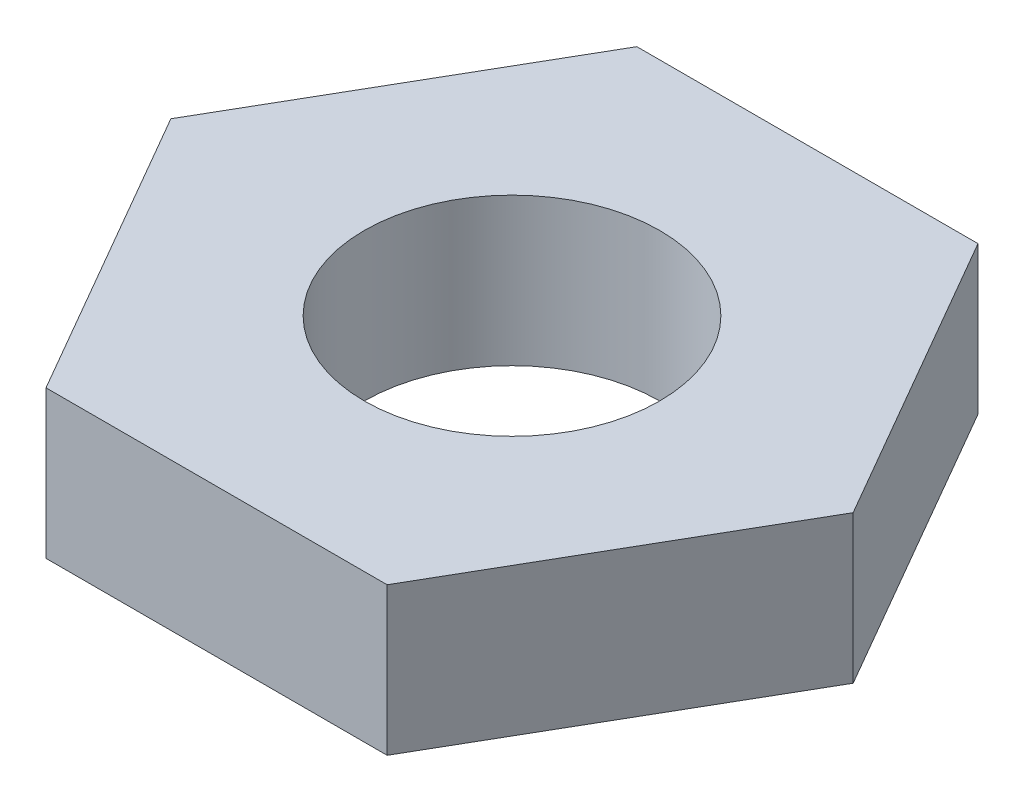
ISO-10303-21;
HEADER;
FILE_DESCRIPTION(('STEP AP214'),'2;1');
FILE_NAME('part.step','',(''),(''),'','','');
FILE_SCHEMA(('AUTOMOTIVE_DESIGN { 1 0 10303 214 1 1 1 1 }'));
ENDSEC;
DATA;
#1=APPLICATION_CONTEXT('core data for automotive mechanical design processes');
#2=APPLICATION_PROTOCOL_DEFINITION('international standard','automotive_design',2000,#1);
#3=PRODUCT_CONTEXT('',#1,'mechanical');
#4=PRODUCT('Part','Part','',(#3));
#5=PRODUCT_RELATED_PRODUCT_CATEGORY('part','',(#4));
#6=PRODUCT_DEFINITION_FORMATION('','',#4);
#7=PRODUCT_DEFINITION_CONTEXT('part definition',#1,'design');
#8=PRODUCT_DEFINITION('design','',#6,#7);
#9=PRODUCT_DEFINITION_SHAPE('','',#8);
#10=(LENGTH_UNIT() NAMED_UNIT(*) SI_UNIT(.MILLI.,.METRE.));
#11=(NAMED_UNIT(*) PLANE_ANGLE_UNIT() SI_UNIT($,.RADIAN.));
#12=(NAMED_UNIT(*) SI_UNIT($,.STERADIAN.) SOLID_ANGLE_UNIT());
#13=UNCERTAINTY_MEASURE_WITH_UNIT(LENGTH_MEASURE(1.E-05),#10,'distance_accuracy_value','');
#14=(GEOMETRIC_REPRESENTATION_CONTEXT(3) GLOBAL_UNCERTAINTY_ASSIGNED_CONTEXT((#13)) GLOBAL_UNIT_ASSIGNED_CONTEXT((#10,
#11,#12)) REPRESENTATION_CONTEXT('',''));
#15=CARTESIAN_POINT('',(0.,0.,0.));
#16=DIRECTION('',(0.,0.,1.));
#17=DIRECTION('',(1.,0.,0.));
#18=AXIS2_PLACEMENT_3D('',#15,#16,#17);
#19=CARTESIAN_POINT('',(0.,2.5,0.));
#20=DIRECTION('',(0.,1.,0.));
#21=DIRECTION('',(0.,0.,1.));
#22=AXIS2_PLACEMENT_3D('',#19,#20,#21);
#23=PLANE('',#22);
#24=DIRECTION('',(-0.499999999999999,0.,0.866025403784439));
#25=VECTOR('',#24,1.);
#26=CARTESIAN_POINT('',(-2.88675134594813,2.5,-5.00000000000002));
#27=LINE('',#26,#25);
#28=CARTESIAN_POINT('',(-2.88675134594813,2.5,-5.00000000000002));
#29=VERTEX_POINT('',#28);
#30=CARTESIAN_POINT('',(-5.77350269189626,2.5,0.));
#31=VERTEX_POINT('',#30);
#32=EDGE_CURVE('E131',#29,#31,#27,.T.);
#33=ORIENTED_EDGE('',*,*,#32,.T.);
#34=DIRECTION('',(0.5,0.,0.866025403784439));
#35=VECTOR('',#34,1.);
#36=CARTESIAN_POINT('',(-5.77350269189626,2.5,0.));
#37=LINE('',#36,#35);
#38=CARTESIAN_POINT('',(-2.88675134594813,2.5,5.));
#39=VERTEX_POINT('',#38);
#40=EDGE_CURVE('E89',#31,#39,#37,.T.);
#41=ORIENTED_EDGE('',*,*,#40,.T.);
#42=DIRECTION('',(1.,0.,0.));
#43=VECTOR('',#42,1.);
#44=CARTESIAN_POINT('',(-2.88675134594813,2.5,5.));
#45=LINE('',#44,#43);
#46=CARTESIAN_POINT('',(2.88675134594813,2.5,5.));
#47=VERTEX_POINT('',#46);
#48=EDGE_CURVE('E102',#39,#47,#45,.T.);
#49=ORIENTED_EDGE('',*,*,#48,.T.);
#50=DIRECTION('',(0.500000000000002,0.,-0.866025403784437));
#51=VECTOR('',#50,1.);
#52=CARTESIAN_POINT('',(2.88675134594813,2.5,5.));
#53=LINE('',#52,#51);
#54=CARTESIAN_POINT('',(5.77350269189627,2.5,0.));
#55=VERTEX_POINT('',#54);
#56=EDGE_CURVE('E96',#47,#55,#53,.T.);
#57=ORIENTED_EDGE('',*,*,#56,.T.);
#58=DIRECTION('',(-0.5,0.,-0.866025403784439));
#59=VECTOR('',#58,1.);
#60=CARTESIAN_POINT('',(5.77350269189627,2.5,0.));
#61=LINE('',#60,#59);
#62=CARTESIAN_POINT('',(2.88675134594813,2.5,-5.00000000000002));
#63=VERTEX_POINT('',#62);
#64=EDGE_CURVE('E100',#55,#63,#61,.T.);
#65=ORIENTED_EDGE('',*,*,#64,.T.);
#66=DIRECTION('',(-1.,0.,0.));
#67=VECTOR('',#66,1.);
#68=CARTESIAN_POINT('',(2.88675134594813,2.5,-5.00000000000002));
#69=LINE('',#68,#67);
#70=EDGE_CURVE('E52',#63,#29,#69,.T.);
#71=ORIENTED_EDGE('',*,*,#70,.T.);
#72=EDGE_LOOP('',(#33,#41,#49,#57,#65,#71));
#73=FACE_BOUND('',#72,.T.);
#74=CARTESIAN_POINT('',(0.,2.5,0.));
#75=DIRECTION('',(0.,1.,0.));
#76=DIRECTION('',(0.,0.,1.));
#77=AXIS2_PLACEMENT_3D('',#74,#75,#76);
#78=CIRCLE('',#77,2.5);
#79=CARTESIAN_POINT('',(0.,2.5,2.5));
#80=VERTEX_POINT('',#79);
#81=EDGE_CURVE('E124',#80,#80,#78,.T.);
#82=ORIENTED_EDGE('',*,*,#81,.F.);
#83=EDGE_LOOP('',(#82));
#84=FACE_BOUND('',#83,.T.);
#85=ADVANCED_FACE('F35',(#73,#84),#23,.T.);
#86=CARTESIAN_POINT('',(0.,0.,0.));
#87=DIRECTION('',(0.,1.,0.));
#88=DIRECTION('',(0.,0.,1.));
#89=AXIS2_PLACEMENT_3D('',#86,#87,#88);
#90=PLANE('',#89);
#91=DIRECTION('',(-0.499999999999999,0.,0.866025403784439));
#92=VECTOR('',#91,1.);
#93=CARTESIAN_POINT('',(-2.88675134594813,0.,-5.00000000000002));
#94=LINE('',#93,#92);
#95=CARTESIAN_POINT('',(-2.88675134594813,0.,-5.00000000000002));
#96=VERTEX_POINT('',#95);
#97=CARTESIAN_POINT('',(-5.77350269189626,0.,0.));
#98=VERTEX_POINT('',#97);
#99=EDGE_CURVE('E120',#96,#98,#94,.T.);
#100=ORIENTED_EDGE('',*,*,#99,.F.);
#101=DIRECTION('',(-1.,0.,0.));
#102=VECTOR('',#101,1.);
#103=CARTESIAN_POINT('',(2.88675134594813,0.,-5.00000000000002));
#104=LINE('',#103,#102);
#105=CARTESIAN_POINT('',(2.88675134594813,0.,-5.00000000000002));
#106=VERTEX_POINT('',#105);
#107=EDGE_CURVE('E81',#106,#96,#104,.T.);
#108=ORIENTED_EDGE('',*,*,#107,.F.);
#109=DIRECTION('',(-0.5,0.,-0.866025403784439));
#110=VECTOR('',#109,1.);
#111=CARTESIAN_POINT('',(5.77350269189627,0.,0.));
#112=LINE('',#111,#110);
#113=CARTESIAN_POINT('',(5.77350269189627,0.,0.));
#114=VERTEX_POINT('',#113);
#115=EDGE_CURVE('E75',#114,#106,#112,.T.);
#116=ORIENTED_EDGE('',*,*,#115,.F.);
#117=DIRECTION('',(0.500000000000002,0.,-0.866025403784437));
#118=VECTOR('',#117,1.);
#119=CARTESIAN_POINT('',(2.88675134594813,0.,5.));
#120=LINE('',#119,#118);
#121=CARTESIAN_POINT('',(2.88675134594813,0.,5.));
#122=VERTEX_POINT('',#121);
#123=EDGE_CURVE('E110',#122,#114,#120,.T.);
#124=ORIENTED_EDGE('',*,*,#123,.F.);
#125=DIRECTION('',(1.,0.,0.));
#126=VECTOR('',#125,1.);
#127=CARTESIAN_POINT('',(-2.88675134594813,0.,5.));
#128=LINE('',#127,#126);
#129=CARTESIAN_POINT('',(-2.88675134594813,0.,5.));
#130=VERTEX_POINT('',#129);
#131=EDGE_CURVE('E126',#130,#122,#128,.T.);
#132=ORIENTED_EDGE('',*,*,#131,.F.);
#133=DIRECTION('',(0.5,0.,0.866025403784439));
#134=VECTOR('',#133,1.);
#135=CARTESIAN_POINT('',(-5.77350269189626,0.,0.));
#136=LINE('',#135,#134);
#137=EDGE_CURVE('E123',#98,#130,#136,.T.);
#138=ORIENTED_EDGE('',*,*,#137,.F.);
#139=EDGE_LOOP('',(#100,#108,#116,#124,#132,#138));
#140=FACE_BOUND('',#139,.T.);
#141=CARTESIAN_POINT('',(0.,0.,0.));
#142=DIRECTION('',(0.,1.,0.));
#143=DIRECTION('',(0.,0.,1.));
#144=AXIS2_PLACEMENT_3D('',#141,#142,#143);
#145=CIRCLE('',#144,2.5);
#146=CARTESIAN_POINT('',(0.,0.,2.5));
#147=VERTEX_POINT('',#146);
#148=EDGE_CURVE('E224',#147,#147,#145,.T.);
#149=ORIENTED_EDGE('',*,*,#148,.T.);
#150=EDGE_LOOP('',(#149));
#151=FACE_BOUND('',#150,.T.);
#152=ADVANCED_FACE('F140',(#140,#151),#90,.F.);
#153=CARTESIAN_POINT('',(-2.88675134594813,2.5,-5.00000000000002));
#154=DIRECTION('',(0.866025403784439,0.,0.499999999999999));
#155=DIRECTION('',(0.499999999999999,0.,-0.866025403784439));
#156=AXIS2_PLACEMENT_3D('',#153,#154,#155);
#157=PLANE('',#156);
#158=ORIENTED_EDGE('',*,*,#99,.T.);
#159=DIRECTION('',(0.,-1.,0.));
#160=VECTOR('',#159,1.);
#161=CARTESIAN_POINT('',(-5.77350269189626,2.5,0.));
#162=LINE('',#161,#160);
#163=EDGE_CURVE('E11',#31,#98,#162,.T.);
#164=ORIENTED_EDGE('',*,*,#163,.F.);
#165=ORIENTED_EDGE('',*,*,#32,.F.);
#166=DIRECTION('',(0.,-1.,0.));
#167=VECTOR('',#166,1.);
#168=CARTESIAN_POINT('',(-2.88675134594813,2.5,-5.00000000000002));
#169=LINE('',#168,#167);
#170=EDGE_CURVE('E116',#29,#96,#169,.T.);
#171=ORIENTED_EDGE('',*,*,#170,.T.);
#172=EDGE_LOOP('',(#158,#164,#165,#171));
#173=FACE_BOUND('',#172,.T.);
#174=ADVANCED_FACE('F37',(#173),#157,.F.);
#175=CARTESIAN_POINT('',(-5.77350269189626,2.5,0.));
#176=DIRECTION('',(0.866025403784439,0.,-0.5));
#177=DIRECTION('',(-0.5,0.,-0.866025403784439));
#178=AXIS2_PLACEMENT_3D('',#175,#176,#177);
#179=PLANE('',#178);
#180=ORIENTED_EDGE('',*,*,#137,.T.);
#181=DIRECTION('',(0.,-1.,0.));
#182=VECTOR('',#181,1.);
#183=CARTESIAN_POINT('',(-2.88675134594813,2.5,5.));
#184=LINE('',#183,#182);
#185=EDGE_CURVE('E44',#39,#130,#184,.T.);
#186=ORIENTED_EDGE('',*,*,#185,.F.);
#187=ORIENTED_EDGE('',*,*,#40,.F.);
#188=ORIENTED_EDGE('',*,*,#163,.T.);
#189=EDGE_LOOP('',(#180,#186,#187,#188));
#190=FACE_BOUND('',#189,.T.);
#191=ADVANCED_FACE('F165',(#190),#179,.F.);
#192=CARTESIAN_POINT('',(-2.88675134594813,2.5,5.));
#193=DIRECTION('',(0.,0.,-1.));
#194=DIRECTION('',(-1.,0.,0.));
#195=AXIS2_PLACEMENT_3D('',#192,#193,#194);
#196=PLANE('',#195);
#197=ORIENTED_EDGE('',*,*,#131,.T.);
#198=DIRECTION('',(0.,-1.,0.));
#199=VECTOR('',#198,1.);
#200=CARTESIAN_POINT('',(2.88675134594813,2.5,5.));
#201=LINE('',#200,#199);
#202=EDGE_CURVE('E111',#47,#122,#201,.T.);
#203=ORIENTED_EDGE('',*,*,#202,.F.);
#204=ORIENTED_EDGE('',*,*,#48,.F.);
#205=ORIENTED_EDGE('',*,*,#185,.T.);
#206=EDGE_LOOP('',(#197,#203,#204,#205));
#207=FACE_BOUND('',#206,.T.);
#208=ADVANCED_FACE('F137',(#207),#196,.F.);
#209=CARTESIAN_POINT('',(2.88675134594813,2.5,5.));
#210=DIRECTION('',(-0.866025403784437,0.,-0.500000000000002));
#211=DIRECTION('',(-0.500000000000002,0.,0.866025403784437));
#212=AXIS2_PLACEMENT_3D('',#209,#210,#211);
#213=PLANE('',#212);
#214=ORIENTED_EDGE('',*,*,#123,.T.);
#215=DIRECTION('',(0.,-1.,0.));
#216=VECTOR('',#215,1.);
#217=CARTESIAN_POINT('',(5.77350269189627,2.5,0.));
#218=LINE('',#217,#216);
#219=EDGE_CURVE('E107',#55,#114,#218,.T.);
#220=ORIENTED_EDGE('',*,*,#219,.F.);
#221=ORIENTED_EDGE('',*,*,#56,.F.);
#222=ORIENTED_EDGE('',*,*,#202,.T.);
#223=EDGE_LOOP('',(#214,#220,#221,#222));
#224=FACE_BOUND('',#223,.T.);
#225=ADVANCED_FACE('F108',(#224),#213,.F.);
#226=CARTESIAN_POINT('',(5.77350269189627,2.5,0.));
#227=DIRECTION('',(-0.866025403784439,0.,0.5));
#228=DIRECTION('',(0.5,0.,0.866025403784439));
#229=AXIS2_PLACEMENT_3D('',#226,#227,#228);
#230=PLANE('',#229);
#231=ORIENTED_EDGE('',*,*,#115,.T.);
#232=DIRECTION('',(0.,-1.,0.));
#233=VECTOR('',#232,1.);
#234=CARTESIAN_POINT('',(2.88675134594813,2.5,-5.00000000000002));
#235=LINE('',#234,#233);
#236=EDGE_CURVE('E112',#63,#106,#235,.T.);
#237=ORIENTED_EDGE('',*,*,#236,.F.);
#238=ORIENTED_EDGE('',*,*,#64,.F.);
#239=ORIENTED_EDGE('',*,*,#219,.T.);
#240=EDGE_LOOP('',(#231,#237,#238,#239));
#241=FACE_BOUND('',#240,.T.);
#242=ADVANCED_FACE('F114',(#241),#230,.F.);
#243=CARTESIAN_POINT('',(2.88675134594813,2.5,-5.00000000000002));
#244=DIRECTION('',(0.,0.,1.));
#245=DIRECTION('',(1.,0.,0.));
#246=AXIS2_PLACEMENT_3D('',#243,#244,#245);
#247=PLANE('',#246);
#248=ORIENTED_EDGE('',*,*,#107,.T.);
#249=ORIENTED_EDGE('',*,*,#170,.F.);
#250=ORIENTED_EDGE('',*,*,#70,.F.);
#251=ORIENTED_EDGE('',*,*,#236,.T.);
#252=EDGE_LOOP('',(#248,#249,#250,#251));
#253=FACE_BOUND('',#252,.T.);
#254=ADVANCED_FACE('F145',(#253),#247,.F.);
#255=CARTESIAN_POINT('',(0.,2.5,0.));
#256=DIRECTION('',(0.,-1.,0.));
#257=DIRECTION('',(0.,0.,-1.));
#258=AXIS2_PLACEMENT_3D('',#255,#256,#257);
#259=CYLINDRICAL_SURFACE('',#258,2.5);
#260=ORIENTED_EDGE('',*,*,#81,.T.);
#261=EDGE_LOOP('',(#260));
#262=FACE_BOUND('',#261,.T.);
#263=ORIENTED_EDGE('',*,*,#148,.F.);
#264=EDGE_LOOP('',(#263));
#265=FACE_BOUND('',#264,.T.);
#266=ADVANCED_FACE('F147',(#262,#265),#259,.F.);
#267=CLOSED_SHELL('',(#85,#152,#174,#191,#208,#225,#242,#254,#266));
#268=MANIFOLD_SOLID_BREP('B2',#267);
#269=ADVANCED_BREP_SHAPE_REPRESENTATION('',(#18,#268),#14);
#270=SHAPE_DEFINITION_REPRESENTATION(#9,#269);
ENDSEC;
END-ISO-10303-21;
